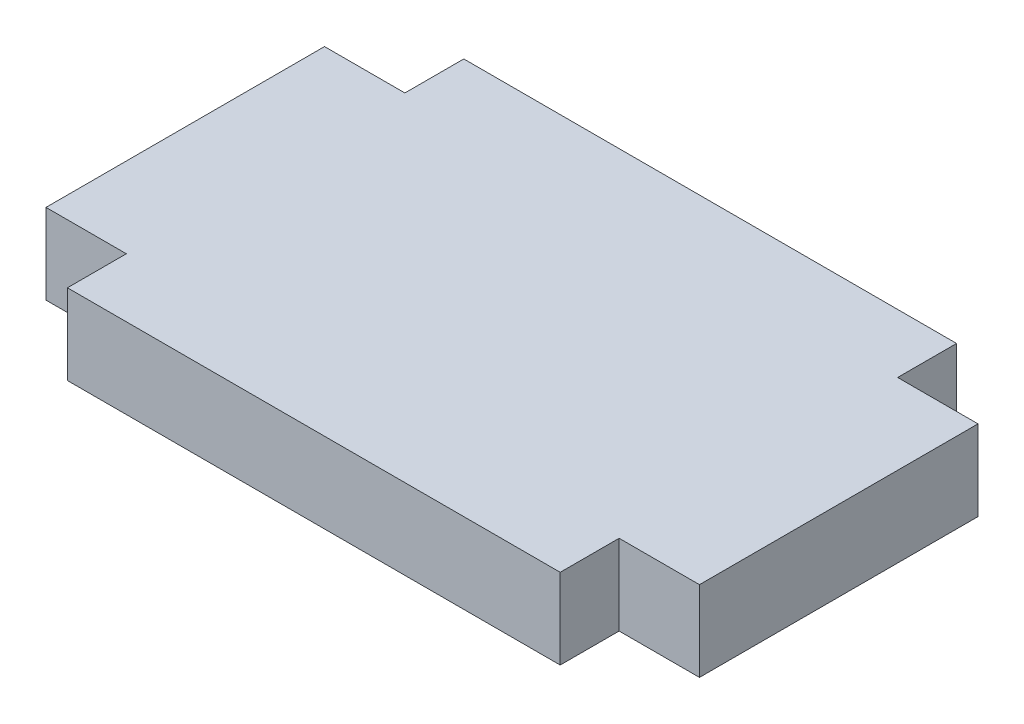
ISO-10303-21;
HEADER;
FILE_DESCRIPTION(('STEP AP214'),'2;1');
FILE_NAME('part.step','',(''),(''),'','','');
FILE_SCHEMA(('AUTOMOTIVE_DESIGN { 1 0 10303 214 1 1 1 1 }'));
ENDSEC;
DATA;
#1=APPLICATION_CONTEXT('core data for automotive mechanical design processes');
#2=APPLICATION_PROTOCOL_DEFINITION('international standard','automotive_design',2000,#1);
#3=PRODUCT_CONTEXT('',#1,'mechanical');
#4=PRODUCT('Part','Part','',(#3));
#5=PRODUCT_RELATED_PRODUCT_CATEGORY('part','',(#4));
#6=PRODUCT_DEFINITION_FORMATION('','',#4);
#7=PRODUCT_DEFINITION_CONTEXT('part definition',#1,'design');
#8=PRODUCT_DEFINITION('design','',#6,#7);
#9=PRODUCT_DEFINITION_SHAPE('','',#8);
#10=(LENGTH_UNIT() NAMED_UNIT(*) SI_UNIT(.MILLI.,.METRE.));
#11=(NAMED_UNIT(*) PLANE_ANGLE_UNIT() SI_UNIT($,.RADIAN.));
#12=(NAMED_UNIT(*) SI_UNIT($,.STERADIAN.) SOLID_ANGLE_UNIT());
#13=UNCERTAINTY_MEASURE_WITH_UNIT(LENGTH_MEASURE(1.E-05),#10,'distance_accuracy_value','');
#14=(GEOMETRIC_REPRESENTATION_CONTEXT(3) GLOBAL_UNCERTAINTY_ASSIGNED_CONTEXT((#13)) GLOBAL_UNIT_ASSIGNED_CONTEXT((#10,
#11,#12)) REPRESENTATION_CONTEXT('',''));
#15=CARTESIAN_POINT('',(0.,0.,0.));
#16=DIRECTION('',(0.,0.,1.));
#17=DIRECTION('',(1.,0.,0.));
#18=AXIS2_PLACEMENT_3D('',#15,#16,#17);
#19=CARTESIAN_POINT('',(0.,9.525,40.005));
#20=DIRECTION('',(0.,0.,-1.));
#21=DIRECTION('',(-1.,0.,0.));
#22=AXIS2_PLACEMENT_3D('',#19,#20,#21);
#23=PLANE('',#22);
#24=DIRECTION('',(1.,0.,0.));
#25=VECTOR('',#24,1.);
#26=CARTESIAN_POINT('',(0.,0.,40.005));
#27=LINE('',#26,#25);
#28=CARTESIAN_POINT('',(0.,0.,40.005));
#29=VERTEX_POINT('',#28);
#30=CARTESIAN_POINT('',(9.52500000000001,0.,40.005));
#31=VERTEX_POINT('',#30);
#32=EDGE_CURVE('E157',#29,#31,#27,.T.);
#33=ORIENTED_EDGE('',*,*,#32,.T.);
#34=DIRECTION('',(0.,-1.,0.));
#35=VECTOR('',#34,1.);
#36=CARTESIAN_POINT('',(9.52500000000001,9.525,40.005));
#37=LINE('',#36,#35);
#38=CARTESIAN_POINT('',(9.52500000000001,9.525,40.005));
#39=VERTEX_POINT('',#38);
#40=EDGE_CURVE('E11',#39,#31,#37,.T.);
#41=ORIENTED_EDGE('',*,*,#40,.F.);
#42=DIRECTION('',(1.,0.,0.));
#43=VECTOR('',#42,1.);
#44=CARTESIAN_POINT('',(0.,9.525,40.005));
#45=LINE('',#44,#43);
#46=CARTESIAN_POINT('',(0.,9.525,40.005));
#47=VERTEX_POINT('',#46);
#48=EDGE_CURVE('E184',#47,#39,#45,.T.);
#49=ORIENTED_EDGE('',*,*,#48,.F.);
#50=DIRECTION('',(0.,-1.,0.));
#51=VECTOR('',#50,1.);
#52=CARTESIAN_POINT('',(0.,9.525,40.005));
#53=LINE('',#52,#51);
#54=EDGE_CURVE('E153',#47,#29,#53,.T.);
#55=ORIENTED_EDGE('',*,*,#54,.T.);
#56=EDGE_LOOP('',(#33,#41,#49,#55));
#57=FACE_BOUND('',#56,.T.);
#58=ADVANCED_FACE('F39',(#57),#23,.F.);
#59=CARTESIAN_POINT('',(9.52499999999999,9.525,0.));
#60=DIRECTION('',(1.,0.,0.));
#61=DIRECTION('',(0.,0.,-1.));
#62=AXIS2_PLACEMENT_3D('',#59,#60,#61);
#63=PLANE('',#62);
#64=DIRECTION('',(0.,0.,1.));
#65=VECTOR('',#64,1.);
#66=CARTESIAN_POINT('',(9.52499999999999,0.,0.));
#67=LINE('',#66,#65);
#68=CARTESIAN_POINT('',(9.52500000000001,0.,46.99));
#69=VERTEX_POINT('',#68);
#70=EDGE_CURVE('E160',#31,#69,#67,.T.);
#71=ORIENTED_EDGE('',*,*,#70,.T.);
#72=DIRECTION('',(0.,-1.,0.));
#73=VECTOR('',#72,1.);
#74=CARTESIAN_POINT('',(9.52500000000001,9.525,46.99));
#75=LINE('',#74,#73);
#76=CARTESIAN_POINT('',(9.52500000000001,9.525,46.99));
#77=VERTEX_POINT('',#76);
#78=EDGE_CURVE('E47',#77,#69,#75,.T.);
#79=ORIENTED_EDGE('',*,*,#78,.F.);
#80=DIRECTION('',(0.,0.,1.));
#81=VECTOR('',#80,1.);
#82=CARTESIAN_POINT('',(9.52499999999999,9.525,0.));
#83=LINE('',#82,#81);
#84=EDGE_CURVE('E106',#39,#77,#83,.T.);
#85=ORIENTED_EDGE('',*,*,#84,.F.);
#86=ORIENTED_EDGE('',*,*,#40,.T.);
#87=EDGE_LOOP('',(#71,#79,#85,#86));
#88=FACE_BOUND('',#87,.T.);
#89=ADVANCED_FACE('F254',(#88),#63,.F.);
#90=CARTESIAN_POINT('',(0.,9.525,46.99));
#91=DIRECTION('',(0.,0.,-1.));
#92=DIRECTION('',(-1.,0.,0.));
#93=AXIS2_PLACEMENT_3D('',#90,#91,#92);
#94=PLANE('',#93);
#95=DIRECTION('',(1.,0.,0.));
#96=VECTOR('',#95,1.);
#97=CARTESIAN_POINT('',(0.,0.,46.99));
#98=LINE('',#97,#96);
#99=CARTESIAN_POINT('',(67.945,0.,46.99));
#100=VERTEX_POINT('',#99);
#101=EDGE_CURVE('E162',#69,#100,#98,.T.);
#102=ORIENTED_EDGE('',*,*,#101,.T.);
#103=DIRECTION('',(0.,-1.,0.));
#104=VECTOR('',#103,1.);
#105=CARTESIAN_POINT('',(67.945,9.525,46.99));
#106=LINE('',#105,#104);
#107=CARTESIAN_POINT('',(67.945,9.525,46.99));
#108=VERTEX_POINT('',#107);
#109=EDGE_CURVE('E200',#108,#100,#106,.T.);
#110=ORIENTED_EDGE('',*,*,#109,.F.);
#111=DIRECTION('',(1.,0.,0.));
#112=VECTOR('',#111,1.);
#113=CARTESIAN_POINT('',(0.,9.525,46.99));
#114=LINE('',#113,#112);
#115=EDGE_CURVE('E208',#77,#108,#114,.T.);
#116=ORIENTED_EDGE('',*,*,#115,.F.);
#117=ORIENTED_EDGE('',*,*,#78,.T.);
#118=EDGE_LOOP('',(#102,#110,#116,#117));
#119=FACE_BOUND('',#118,.T.);
#120=ADVANCED_FACE('F206',(#119),#94,.F.);
#121=CARTESIAN_POINT('',(67.9449999999999,9.525,-1.34993026857831E-13));
#122=DIRECTION('',(-1.,0.,0.));
#123=DIRECTION('',(0.,0.,1.));
#124=AXIS2_PLACEMENT_3D('',#121,#122,#123);
#125=PLANE('',#124);
#126=DIRECTION('',(0.,0.,-1.));
#127=VECTOR('',#126,1.);
#128=CARTESIAN_POINT('',(67.9449999999999,0.,-1.34993026857831E-13));
#129=LINE('',#128,#127);
#130=CARTESIAN_POINT('',(67.945,0.,40.005));
#131=VERTEX_POINT('',#130);
#132=EDGE_CURVE('E164',#100,#131,#129,.T.);
#133=ORIENTED_EDGE('',*,*,#132,.T.);
#134=DIRECTION('',(0.,-1.,0.));
#135=VECTOR('',#134,1.);
#136=CARTESIAN_POINT('',(67.945,9.525,40.005));
#137=LINE('',#136,#135);
#138=CARTESIAN_POINT('',(67.945,9.525,40.005));
#139=VERTEX_POINT('',#138);
#140=EDGE_CURVE('E197',#139,#131,#137,.T.);
#141=ORIENTED_EDGE('',*,*,#140,.F.);
#142=DIRECTION('',(0.,0.,-1.));
#143=VECTOR('',#142,1.);
#144=CARTESIAN_POINT('',(67.9449999999999,9.525,-1.34993026857831E-13));
#145=LINE('',#144,#143);
#146=EDGE_CURVE('E226',#108,#139,#145,.T.);
#147=ORIENTED_EDGE('',*,*,#146,.F.);
#148=ORIENTED_EDGE('',*,*,#109,.T.);
#149=EDGE_LOOP('',(#133,#141,#147,#148));
#150=FACE_BOUND('',#149,.T.);
#151=ADVANCED_FACE('F216',(#150),#125,.F.);
#152=CARTESIAN_POINT('',(0.,9.525,40.005));
#153=DIRECTION('',(0.,0.,-1.));
#154=DIRECTION('',(-1.,0.,0.));
#155=AXIS2_PLACEMENT_3D('',#152,#153,#154);
#156=PLANE('',#155);
#157=DIRECTION('',(1.,0.,0.));
#158=VECTOR('',#157,1.);
#159=CARTESIAN_POINT('',(0.,0.,40.005));
#160=LINE('',#159,#158);
#161=CARTESIAN_POINT('',(77.47,0.,40.005));
#162=VERTEX_POINT('',#161);
#163=EDGE_CURVE('E166',#131,#162,#160,.T.);
#164=ORIENTED_EDGE('',*,*,#163,.T.);
#165=DIRECTION('',(0.,-1.,0.));
#166=VECTOR('',#165,1.);
#167=CARTESIAN_POINT('',(77.47,9.525,40.005));
#168=LINE('',#167,#166);
#169=CARTESIAN_POINT('',(77.47,9.525,40.005));
#170=VERTEX_POINT('',#169);
#171=EDGE_CURVE('E195',#170,#162,#168,.T.);
#172=ORIENTED_EDGE('',*,*,#171,.F.);
#173=DIRECTION('',(1.,0.,0.));
#174=VECTOR('',#173,1.);
#175=CARTESIAN_POINT('',(0.,9.525,40.005));
#176=LINE('',#175,#174);
#177=EDGE_CURVE('E222',#139,#170,#176,.T.);
#178=ORIENTED_EDGE('',*,*,#177,.F.);
#179=ORIENTED_EDGE('',*,*,#140,.T.);
#180=EDGE_LOOP('',(#164,#172,#178,#179));
#181=FACE_BOUND('',#180,.T.);
#182=ADVANCED_FACE('F220',(#181),#156,.F.);
#183=CARTESIAN_POINT('',(77.47,9.525,0.));
#184=DIRECTION('',(1.,0.,0.));
#185=DIRECTION('',(0.,0.,-1.));
#186=AXIS2_PLACEMENT_3D('',#183,#184,#185);
#187=PLANE('',#186);
#188=DIRECTION('',(0.,0.,1.));
#189=VECTOR('',#188,1.);
#190=CARTESIAN_POINT('',(77.47,0.,0.));
#191=LINE('',#190,#189);
#192=CARTESIAN_POINT('',(77.47,0.,6.985));
#193=VERTEX_POINT('',#192);
#194=EDGE_CURVE('E169',#193,#162,#191,.T.);
#195=ORIENTED_EDGE('',*,*,#194,.F.);
#196=DIRECTION('',(0.,-1.,0.));
#197=VECTOR('',#196,1.);
#198=CARTESIAN_POINT('',(77.47,9.525,6.985));
#199=LINE('',#198,#197);
#200=CARTESIAN_POINT('',(77.47,9.525,6.985));
#201=VERTEX_POINT('',#200);
#202=EDGE_CURVE('E193',#201,#193,#199,.T.);
#203=ORIENTED_EDGE('',*,*,#202,.F.);
#204=DIRECTION('',(0.,0.,1.));
#205=VECTOR('',#204,1.);
#206=CARTESIAN_POINT('',(77.47,9.525,0.));
#207=LINE('',#206,#205);
#208=EDGE_CURVE('E225',#201,#170,#207,.T.);
#209=ORIENTED_EDGE('',*,*,#208,.T.);
#210=ORIENTED_EDGE('',*,*,#171,.T.);
#211=EDGE_LOOP('',(#195,#203,#209,#210));
#212=FACE_BOUND('',#211,.T.);
#213=ADVANCED_FACE('F267',(#212),#187,.T.);
#214=CARTESIAN_POINT('',(0.,9.525,6.98500000000002));
#215=DIRECTION('',(0.,0.,1.));
#216=DIRECTION('',(1.,0.,0.));
#217=AXIS2_PLACEMENT_3D('',#214,#215,#216);
#218=PLANE('',#217);
#219=DIRECTION('',(-1.,0.,0.));
#220=VECTOR('',#219,1.);
#221=CARTESIAN_POINT('',(0.,0.,6.98500000000002));
#222=LINE('',#221,#220);
#223=CARTESIAN_POINT('',(67.945,0.,6.985));
#224=VERTEX_POINT('',#223);
#225=EDGE_CURVE('E172',#193,#224,#222,.T.);
#226=ORIENTED_EDGE('',*,*,#225,.T.);
#227=DIRECTION('',(0.,-1.,0.));
#228=VECTOR('',#227,1.);
#229=CARTESIAN_POINT('',(67.945,9.525,6.985));
#230=LINE('',#229,#228);
#231=CARTESIAN_POINT('',(67.945,9.525,6.985));
#232=VERTEX_POINT('',#231);
#233=EDGE_CURVE('E190',#232,#224,#230,.T.);
#234=ORIENTED_EDGE('',*,*,#233,.F.);
#235=DIRECTION('',(-1.,0.,0.));
#236=VECTOR('',#235,1.);
#237=CARTESIAN_POINT('',(0.,9.525,6.98500000000002));
#238=LINE('',#237,#236);
#239=EDGE_CURVE('E228',#201,#232,#238,.T.);
#240=ORIENTED_EDGE('',*,*,#239,.F.);
#241=ORIENTED_EDGE('',*,*,#202,.T.);
#242=EDGE_LOOP('',(#226,#234,#240,#241));
#243=FACE_BOUND('',#242,.T.);
#244=ADVANCED_FACE('F270',(#243),#218,.F.);
#245=CARTESIAN_POINT('',(67.945,9.525,0.));
#246=DIRECTION('',(-1.,0.,0.));
#247=DIRECTION('',(0.,0.,1.));
#248=AXIS2_PLACEMENT_3D('',#245,#246,#247);
#249=PLANE('',#248);
#250=DIRECTION('',(0.,0.,-1.));
#251=VECTOR('',#250,1.);
#252=CARTESIAN_POINT('',(67.945,0.,0.));
#253=LINE('',#252,#251);
#254=CARTESIAN_POINT('',(67.945,0.,0.));
#255=VERTEX_POINT('',#254);
#256=EDGE_CURVE('E174',#224,#255,#253,.T.);
#257=ORIENTED_EDGE('',*,*,#256,.T.);
#258=DIRECTION('',(0.,-1.,0.));
#259=VECTOR('',#258,1.);
#260=CARTESIAN_POINT('',(67.945,9.525,0.));
#261=LINE('',#260,#259);
#262=CARTESIAN_POINT('',(67.945,9.525,0.));
#263=VERTEX_POINT('',#262);
#264=EDGE_CURVE('E188',#263,#255,#261,.T.);
#265=ORIENTED_EDGE('',*,*,#264,.F.);
#266=DIRECTION('',(0.,0.,-1.));
#267=VECTOR('',#266,1.);
#268=CARTESIAN_POINT('',(67.945,9.525,0.));
#269=LINE('',#268,#267);
#270=EDGE_CURVE('E234',#232,#263,#269,.T.);
#271=ORIENTED_EDGE('',*,*,#270,.F.);
#272=ORIENTED_EDGE('',*,*,#233,.T.);
#273=EDGE_LOOP('',(#257,#265,#271,#272));
#274=FACE_BOUND('',#273,.T.);
#275=ADVANCED_FACE('F274',(#274),#249,.F.);
#276=CARTESIAN_POINT('',(0.,9.525,0.));
#277=DIRECTION('',(0.,0.,-1.));
#278=DIRECTION('',(-1.,0.,0.));
#279=AXIS2_PLACEMENT_3D('',#276,#277,#278);
#280=PLANE('',#279);
#281=DIRECTION('',(1.,0.,0.));
#282=VECTOR('',#281,1.);
#283=CARTESIAN_POINT('',(0.,0.,0.));
#284=LINE('',#283,#282);
#285=CARTESIAN_POINT('',(9.525,0.,0.));
#286=VERTEX_POINT('',#285);
#287=EDGE_CURVE('E177',#286,#255,#284,.T.);
#288=ORIENTED_EDGE('',*,*,#287,.F.);
#289=DIRECTION('',(0.,-1.,0.));
#290=VECTOR('',#289,1.);
#291=CARTESIAN_POINT('',(9.525,9.525,0.));
#292=LINE('',#291,#290);
#293=CARTESIAN_POINT('',(9.525,9.525,0.));
#294=VERTEX_POINT('',#293);
#295=EDGE_CURVE('E143',#294,#286,#292,.T.);
#296=ORIENTED_EDGE('',*,*,#295,.F.);
#297=DIRECTION('',(1.,0.,0.));
#298=VECTOR('',#297,1.);
#299=CARTESIAN_POINT('',(0.,9.525,0.));
#300=LINE('',#299,#298);
#301=EDGE_CURVE('E149',#294,#263,#300,.T.);
#302=ORIENTED_EDGE('',*,*,#301,.T.);
#303=ORIENTED_EDGE('',*,*,#264,.T.);
#304=EDGE_LOOP('',(#288,#296,#302,#303));
#305=FACE_BOUND('',#304,.T.);
#306=ADVANCED_FACE('F237',(#305),#280,.T.);
#307=CARTESIAN_POINT('',(9.525,9.525,0.));
#308=DIRECTION('',(-1.,0.,0.));
#309=DIRECTION('',(0.,0.,1.));
#310=AXIS2_PLACEMENT_3D('',#307,#308,#309);
#311=PLANE('',#310);
#312=DIRECTION('',(0.,0.,-1.));
#313=VECTOR('',#312,1.);
#314=CARTESIAN_POINT('',(9.525,0.,0.));
#315=LINE('',#314,#313);
#316=CARTESIAN_POINT('',(9.525,0.,6.985));
#317=VERTEX_POINT('',#316);
#318=EDGE_CURVE('E138',#317,#286,#315,.T.);
#319=ORIENTED_EDGE('',*,*,#318,.F.);
#320=DIRECTION('',(0.,-1.,0.));
#321=VECTOR('',#320,1.);
#322=CARTESIAN_POINT('',(9.525,9.525,6.985));
#323=LINE('',#322,#321);
#324=CARTESIAN_POINT('',(9.525,9.525,6.985));
#325=VERTEX_POINT('',#324);
#326=EDGE_CURVE('E133',#325,#317,#323,.T.);
#327=ORIENTED_EDGE('',*,*,#326,.F.);
#328=DIRECTION('',(0.,0.,-1.));
#329=VECTOR('',#328,1.);
#330=CARTESIAN_POINT('',(9.525,9.525,0.));
#331=LINE('',#330,#329);
#332=EDGE_CURVE('E136',#325,#294,#331,.T.);
#333=ORIENTED_EDGE('',*,*,#332,.T.);
#334=ORIENTED_EDGE('',*,*,#295,.T.);
#335=EDGE_LOOP('',(#319,#327,#333,#334));
#336=FACE_BOUND('',#335,.T.);
#337=ADVANCED_FACE('F135',(#336),#311,.T.);
#338=CARTESIAN_POINT('',(0.,9.525,6.985));
#339=DIRECTION('',(0.,0.,-1.));
#340=DIRECTION('',(-1.,0.,0.));
#341=AXIS2_PLACEMENT_3D('',#338,#339,#340);
#342=PLANE('',#341);
#343=DIRECTION('',(1.,0.,0.));
#344=VECTOR('',#343,1.);
#345=CARTESIAN_POINT('',(0.,0.,6.985));
#346=LINE('',#345,#344);
#347=CARTESIAN_POINT('',(0.,0.,6.985));
#348=VERTEX_POINT('',#347);
#349=EDGE_CURVE('E181',#348,#317,#346,.T.);
#350=ORIENTED_EDGE('',*,*,#349,.F.);
#351=DIRECTION('',(0.,-1.,0.));
#352=VECTOR('',#351,1.);
#353=CARTESIAN_POINT('',(0.,9.525,6.985));
#354=LINE('',#353,#352);
#355=CARTESIAN_POINT('',(0.,9.525,6.985));
#356=VERTEX_POINT('',#355);
#357=EDGE_CURVE('E95',#356,#348,#354,.T.);
#358=ORIENTED_EDGE('',*,*,#357,.F.);
#359=DIRECTION('',(1.,0.,0.));
#360=VECTOR('',#359,1.);
#361=CARTESIAN_POINT('',(0.,9.525,6.985));
#362=LINE('',#361,#360);
#363=EDGE_CURVE('E147',#356,#325,#362,.T.);
#364=ORIENTED_EDGE('',*,*,#363,.T.);
#365=ORIENTED_EDGE('',*,*,#326,.T.);
#366=EDGE_LOOP('',(#350,#358,#364,#365));
#367=FACE_BOUND('',#366,.T.);
#368=ADVANCED_FACE('F151',(#367),#342,.T.);
#369=CARTESIAN_POINT('',(0.,9.525,0.));
#370=DIRECTION('',(1.,0.,0.));
#371=DIRECTION('',(0.,0.,-1.));
#372=AXIS2_PLACEMENT_3D('',#369,#370,#371);
#373=PLANE('',#372);
#374=DIRECTION('',(0.,0.,1.));
#375=VECTOR('',#374,1.);
#376=CARTESIAN_POINT('',(0.,0.,0.));
#377=LINE('',#376,#375);
#378=EDGE_CURVE('E98',#348,#29,#377,.T.);
#379=ORIENTED_EDGE('',*,*,#378,.T.);
#380=ORIENTED_EDGE('',*,*,#54,.F.);
#381=DIRECTION('',(0.,0.,1.));
#382=VECTOR('',#381,1.);
#383=CARTESIAN_POINT('',(0.,9.525,0.));
#384=LINE('',#383,#382);
#385=EDGE_CURVE('E55',#356,#47,#384,.T.);
#386=ORIENTED_EDGE('',*,*,#385,.F.);
#387=ORIENTED_EDGE('',*,*,#357,.T.);
#388=EDGE_LOOP('',(#379,#380,#386,#387));
#389=FACE_BOUND('',#388,.T.);
#390=ADVANCED_FACE('F243',(#389),#373,.F.);
#391=CARTESIAN_POINT('',(0.,9.525,0.));
#392=DIRECTION('',(0.,1.,0.));
#393=DIRECTION('',(0.,0.,1.));
#394=AXIS2_PLACEMENT_3D('',#391,#392,#393);
#395=PLANE('',#394);
#396=ORIENTED_EDGE('',*,*,#48,.T.);
#397=ORIENTED_EDGE('',*,*,#84,.T.);
#398=ORIENTED_EDGE('',*,*,#115,.T.);
#399=ORIENTED_EDGE('',*,*,#146,.T.);
#400=ORIENTED_EDGE('',*,*,#177,.T.);
#401=ORIENTED_EDGE('',*,*,#208,.F.);
#402=ORIENTED_EDGE('',*,*,#239,.T.);
#403=ORIENTED_EDGE('',*,*,#270,.T.);
#404=ORIENTED_EDGE('',*,*,#301,.F.);
#405=ORIENTED_EDGE('',*,*,#332,.F.);
#406=ORIENTED_EDGE('',*,*,#363,.F.);
#407=ORIENTED_EDGE('',*,*,#385,.T.);
#408=EDGE_LOOP('',(#396,#397,#398,#399,#400,#401,#402,#403,#404,#405,#406,#407));
#409=FACE_BOUND('',#408,.T.);
#410=ADVANCED_FACE('F146',(#409),#395,.T.);
#411=CARTESIAN_POINT('',(0.,0.,0.));
#412=DIRECTION('',(0.,1.,0.));
#413=DIRECTION('',(0.,0.,1.));
#414=AXIS2_PLACEMENT_3D('',#411,#412,#413);
#415=PLANE('',#414);
#416=ORIENTED_EDGE('',*,*,#32,.F.);
#417=ORIENTED_EDGE('',*,*,#378,.F.);
#418=ORIENTED_EDGE('',*,*,#349,.T.);
#419=ORIENTED_EDGE('',*,*,#318,.T.);
#420=ORIENTED_EDGE('',*,*,#287,.T.);
#421=ORIENTED_EDGE('',*,*,#256,.F.);
#422=ORIENTED_EDGE('',*,*,#225,.F.);
#423=ORIENTED_EDGE('',*,*,#194,.T.);
#424=ORIENTED_EDGE('',*,*,#163,.F.);
#425=ORIENTED_EDGE('',*,*,#132,.F.);
#426=ORIENTED_EDGE('',*,*,#101,.F.);
#427=ORIENTED_EDGE('',*,*,#70,.F.);
#428=EDGE_LOOP('',(#416,#417,#418,#419,#420,#421,#422,#423,#424,#425,#426,#427));
#429=FACE_BOUND('',#428,.T.);
#430=ADVANCED_FACE('F212',(#429),#415,.F.);
#431=CLOSED_SHELL('',(#58,#89,#120,#151,#182,#213,#244,#275,#306,#337,#368,#390,#410,#430));
#432=MANIFOLD_SOLID_BREP('B2',#431);
#433=ADVANCED_BREP_SHAPE_REPRESENTATION('',(#18,#432),#14);
#434=SHAPE_DEFINITION_REPRESENTATION(#9,#433);
ENDSEC;
END-ISO-10303-21;
